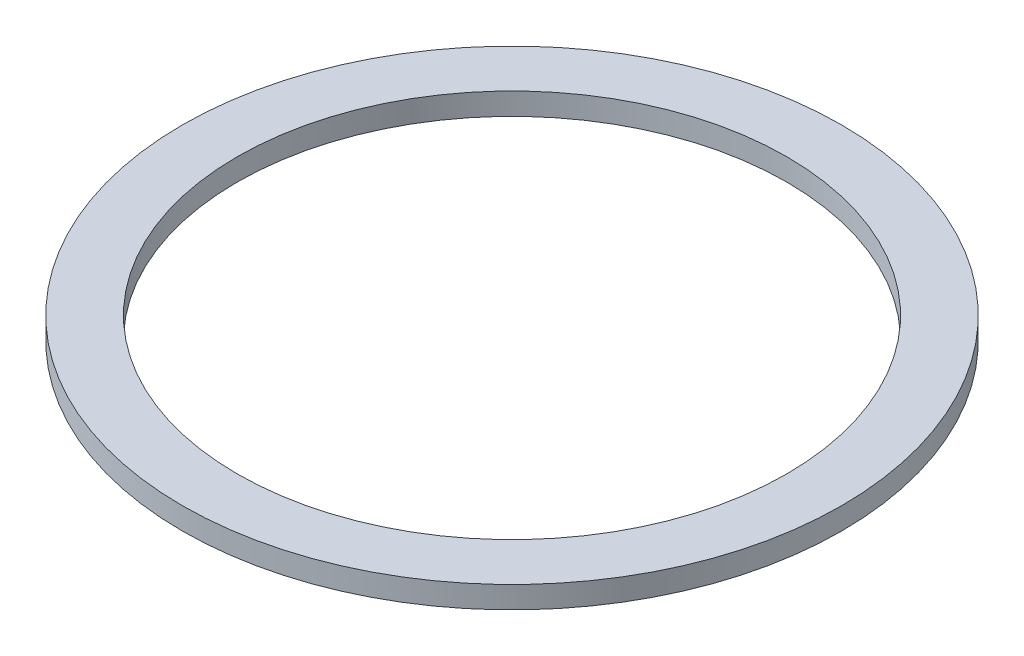
ISO-10303-21;
HEADER;
FILE_DESCRIPTION(('STEP AP214'),'2;1');
FILE_NAME('part.step','',(''),(''),'','','');
FILE_SCHEMA(('AUTOMOTIVE_DESIGN { 1 0 10303 214 1 1 1 1 }'));
ENDSEC;
DATA;
#1=APPLICATION_CONTEXT('core data for automotive mechanical design processes');
#2=APPLICATION_PROTOCOL_DEFINITION('international standard','automotive_design',2000,#1);
#3=PRODUCT_CONTEXT('',#1,'mechanical');
#4=PRODUCT('Part','Part','',(#3));
#5=PRODUCT_RELATED_PRODUCT_CATEGORY('part','',(#4));
#6=PRODUCT_DEFINITION_FORMATION('','',#4);
#7=PRODUCT_DEFINITION_CONTEXT('part definition',#1,'design');
#8=PRODUCT_DEFINITION('design','',#6,#7);
#9=PRODUCT_DEFINITION_SHAPE('','',#8);
#10=(LENGTH_UNIT() NAMED_UNIT(*) SI_UNIT(.MILLI.,.METRE.));
#11=(NAMED_UNIT(*) PLANE_ANGLE_UNIT() SI_UNIT($,.RADIAN.));
#12=(NAMED_UNIT(*) SI_UNIT($,.STERADIAN.) SOLID_ANGLE_UNIT());
#13=UNCERTAINTY_MEASURE_WITH_UNIT(LENGTH_MEASURE(1.E-05),#10,'distance_accuracy_value','');
#14=(GEOMETRIC_REPRESENTATION_CONTEXT(3) GLOBAL_UNCERTAINTY_ASSIGNED_CONTEXT((#13)) GLOBAL_UNIT_ASSIGNED_CONTEXT((#10,
#11,#12)) REPRESENTATION_CONTEXT('',''));
#15=CARTESIAN_POINT('',(0.,0.,0.));
#16=DIRECTION('',(0.,0.,1.));
#17=DIRECTION('',(1.,0.,0.));
#18=AXIS2_PLACEMENT_3D('',#15,#16,#17);
#19=CARTESIAN_POINT('',(0.,-0.5,0.));
#20=DIRECTION('',(0.,1.,0.));
#21=DIRECTION('',(0.,0.,1.));
#22=AXIS2_PLACEMENT_3D('',#19,#20,#21);
#23=TOROIDAL_SURFACE('',#22,27.5,1.5);
#24=CARTESIAN_POINT('',(0.,0.,0.));
#25=DIRECTION('',(0.,1.,0.));
#26=DIRECTION('',(0.,0.,1.));
#27=AXIS2_PLACEMENT_3D('',#24,#25,#26);
#28=CIRCLE('',#27,26.0857864376269);
#29=CARTESIAN_POINT('',(0.,0.,26.0857864376269));
#30=VERTEX_POINT('',#29);
#31=EDGE_CURVE('E56',#30,#30,#28,.T.);
#32=ORIENTED_EDGE('',*,*,#31,.T.);
#33=EDGE_LOOP('',(#32));
#34=FACE_BOUND('',#33,.T.);
#35=CARTESIAN_POINT('',(0.,0.,0.));
#36=DIRECTION('',(0.,1.,0.));
#37=DIRECTION('',(0.,0.,1.));
#38=AXIS2_PLACEMENT_3D('',#35,#36,#37);
#39=CIRCLE('',#38,28.9142135623731);
#40=CARTESIAN_POINT('',(0.,0.,28.9142135623731));
#41=VERTEX_POINT('',#40);
#42=EDGE_CURVE('E10',#41,#41,#39,.T.);
#43=ORIENTED_EDGE('',*,*,#42,.F.);
#44=EDGE_LOOP('',(#43));
#45=FACE_BOUND('',#44,.T.);
#46=ADVANCED_FACE('F34',(#34,#45),#23,.F.);
#47=CARTESIAN_POINT('',(0.,0.,0.));
#48=DIRECTION('',(0.,1.,0.));
#49=DIRECTION('',(0.,0.,1.));
#50=AXIS2_PLACEMENT_3D('',#47,#48,#49);
#51=PLANE('',#50);
#52=CARTESIAN_POINT('',(0.,0.,0.));
#53=DIRECTION('',(0.,1.,0.));
#54=DIRECTION('',(0.,0.,1.));
#55=AXIS2_PLACEMENT_3D('',#52,#53,#54);
#56=CIRCLE('',#55,30.);
#57=CARTESIAN_POINT('',(0.,0.,30.));
#58=VERTEX_POINT('',#57);
#59=EDGE_CURVE('E40',#58,#58,#56,.T.);
#60=ORIENTED_EDGE('',*,*,#59,.F.);
#61=EDGE_LOOP('',(#60));
#62=FACE_BOUND('',#61,.T.);
#63=ORIENTED_EDGE('',*,*,#42,.T.);
#64=EDGE_LOOP('',(#63));
#65=FACE_BOUND('',#64,.T.);
#66=ADVANCED_FACE('F67',(#62,#65),#51,.F.);
#67=CARTESIAN_POINT('',(0.,22.7580021151555,0.));
#68=DIRECTION('',(0.,1.,0.));
#69=DIRECTION('',(0.,0.,1.));
#70=AXIS2_PLACEMENT_3D('',#67,#68,#69);
#71=CYLINDRICAL_SURFACE('',#70,30.);
#72=CARTESIAN_POINT('',(0.,2.,0.));
#73=DIRECTION('',(0.,1.,0.));
#74=DIRECTION('',(0.,0.,1.));
#75=AXIS2_PLACEMENT_3D('',#72,#73,#74);
#76=CIRCLE('',#75,30.);
#77=CARTESIAN_POINT('',(0.,2.,30.));
#78=VERTEX_POINT('',#77);
#79=EDGE_CURVE('E44',#78,#78,#76,.T.);
#80=ORIENTED_EDGE('',*,*,#79,.F.);
#81=EDGE_LOOP('',(#80));
#82=FACE_BOUND('',#81,.T.);
#83=ORIENTED_EDGE('',*,*,#59,.T.);
#84=EDGE_LOOP('',(#83));
#85=FACE_BOUND('',#84,.T.);
#86=ADVANCED_FACE('F77',(#82,#85),#71,.T.);
#87=CARTESIAN_POINT('',(0.,2.,0.));
#88=DIRECTION('',(0.,1.,0.));
#89=DIRECTION('',(0.,0.,1.));
#90=AXIS2_PLACEMENT_3D('',#87,#88,#89);
#91=PLANE('',#90);
#92=ORIENTED_EDGE('',*,*,#79,.T.);
#93=EDGE_LOOP('',(#92));
#94=FACE_BOUND('',#93,.T.);
#95=CARTESIAN_POINT('',(0.,2.,0.));
#96=DIRECTION('',(0.,1.,0.));
#97=DIRECTION('',(0.,0.,1.));
#98=AXIS2_PLACEMENT_3D('',#95,#96,#97);
#99=CIRCLE('',#98,25.);
#100=CARTESIAN_POINT('',(0.,2.,25.));
#101=VERTEX_POINT('',#100);
#102=EDGE_CURVE('E48',#101,#101,#99,.T.);
#103=ORIENTED_EDGE('',*,*,#102,.F.);
#104=EDGE_LOOP('',(#103));
#105=FACE_BOUND('',#104,.T.);
#106=ADVANCED_FACE('F71',(#94,#105),#91,.T.);
#107=CARTESIAN_POINT('',(0.,22.7580021151555,0.));
#108=DIRECTION('',(0.,1.,0.));
#109=DIRECTION('',(0.,0.,1.));
#110=AXIS2_PLACEMENT_3D('',#107,#108,#109);
#111=CYLINDRICAL_SURFACE('',#110,25.);
#112=ORIENTED_EDGE('',*,*,#102,.T.);
#113=EDGE_LOOP('',(#112));
#114=FACE_BOUND('',#113,.T.);
#115=CARTESIAN_POINT('',(0.,0.,0.));
#116=DIRECTION('',(0.,1.,0.));
#117=DIRECTION('',(0.,0.,1.));
#118=AXIS2_PLACEMENT_3D('',#115,#116,#117);
#119=CIRCLE('',#118,25.);
#120=CARTESIAN_POINT('',(0.,0.,25.));
#121=VERTEX_POINT('',#120);
#122=EDGE_CURVE('E53',#121,#121,#119,.T.);
#123=ORIENTED_EDGE('',*,*,#122,.F.);
#124=EDGE_LOOP('',(#123));
#125=FACE_BOUND('',#124,.T.);
#126=ADVANCED_FACE('F65',(#114,#125),#111,.F.);
#127=ORIENTED_EDGE('',*,*,#31,.F.);
#128=EDGE_LOOP('',(#127));
#129=FACE_BOUND('',#128,.T.);
#130=ORIENTED_EDGE('',*,*,#122,.T.);
#131=EDGE_LOOP('',(#130));
#132=FACE_BOUND('',#131,.T.);
#133=ADVANCED_FACE('F62',(#129,#132),#51,.F.);
#134=CLOSED_SHELL('',(#46,#66,#86,#106,#126,#133));
#135=MANIFOLD_SOLID_BREP('B2',#134);
#136=ADVANCED_BREP_SHAPE_REPRESENTATION('',(#18,#135),#14);
#137=SHAPE_DEFINITION_REPRESENTATION(#9,#136);
ENDSEC;
END-ISO-10303-21;
